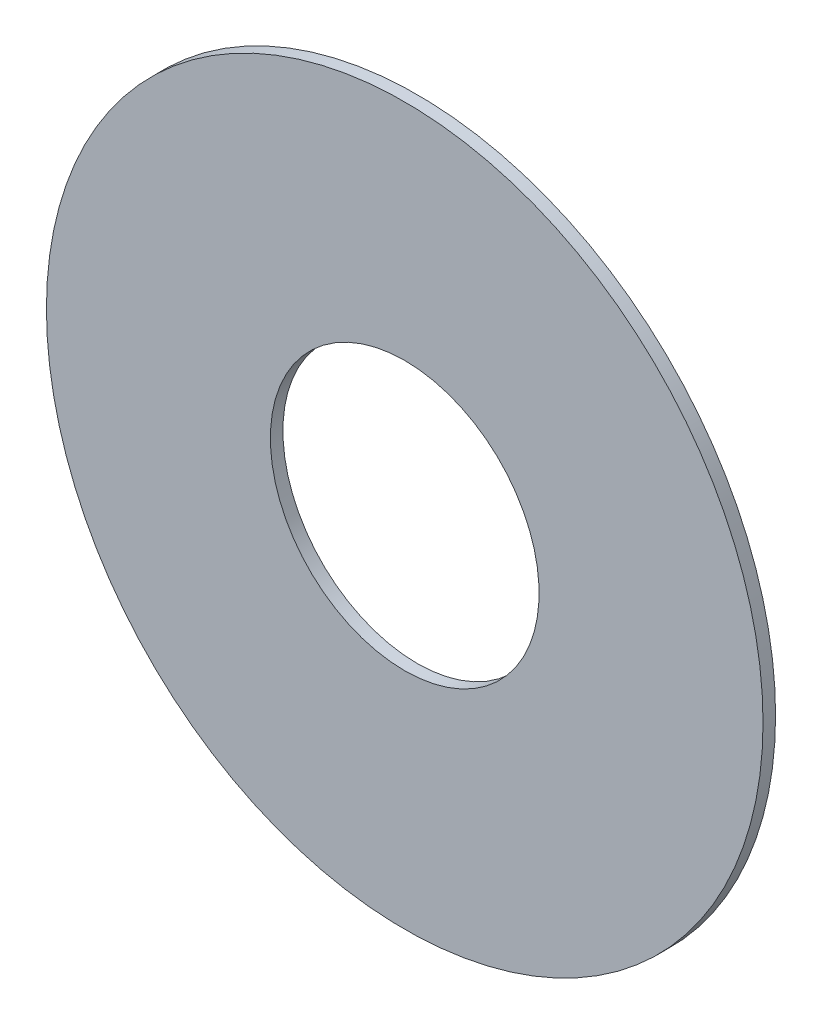
ISO-10303-21;
HEADER;
FILE_DESCRIPTION(('STEP AP214'),'2;1');
FILE_NAME('part.step','',(''),(''),'','','');
FILE_SCHEMA(('AUTOMOTIVE_DESIGN { 1 0 10303 214 1 1 1 1 }'));
ENDSEC;
DATA;
#1=APPLICATION_CONTEXT('core data for automotive mechanical design processes');
#2=APPLICATION_PROTOCOL_DEFINITION('international standard','automotive_design',2000,#1);
#3=PRODUCT_CONTEXT('',#1,'mechanical');
#4=PRODUCT('Part','Part','',(#3));
#5=PRODUCT_RELATED_PRODUCT_CATEGORY('part','',(#4));
#6=PRODUCT_DEFINITION_FORMATION('','',#4);
#7=PRODUCT_DEFINITION_CONTEXT('part definition',#1,'design');
#8=PRODUCT_DEFINITION('design','',#6,#7);
#9=PRODUCT_DEFINITION_SHAPE('','',#8);
#10=(LENGTH_UNIT() NAMED_UNIT(*) SI_UNIT(.MILLI.,.METRE.));
#11=(NAMED_UNIT(*) PLANE_ANGLE_UNIT() SI_UNIT($,.RADIAN.));
#12=(NAMED_UNIT(*) SI_UNIT($,.STERADIAN.) SOLID_ANGLE_UNIT());
#13=UNCERTAINTY_MEASURE_WITH_UNIT(LENGTH_MEASURE(1.E-05),#10,'distance_accuracy_value','');
#14=(GEOMETRIC_REPRESENTATION_CONTEXT(3) GLOBAL_UNCERTAINTY_ASSIGNED_CONTEXT((#13)) GLOBAL_UNIT_ASSIGNED_CONTEXT((#10,
#11,#12)) REPRESENTATION_CONTEXT('',''));
#15=CARTESIAN_POINT('',(0.,0.,0.));
#16=DIRECTION('',(0.,0.,1.));
#17=DIRECTION('',(1.,0.,0.));
#18=AXIS2_PLACEMENT_3D('',#15,#16,#17);
#19=CARTESIAN_POINT('',(141.224,-73.152,-0.045));
#20=DIRECTION('',(0.,0.,-1.));
#21=DIRECTION('',(0.,-1.,0.));
#22=AXIS2_PLACEMENT_3D('',#19,#20,#21);
#23=CYLINDRICAL_SURFACE('',#22,0.375);
#24=CARTESIAN_POINT('',(141.224,-73.152,-0.035));
#25=DIRECTION('',(0.,0.,-1.));
#26=DIRECTION('',(0.,-1.,0.));
#27=AXIS2_PLACEMENT_3D('',#24,#25,#26);
#28=CIRCLE('',#27,0.375);
#29=CARTESIAN_POINT('',(141.224,-73.527,-0.035));
#30=VERTEX_POINT('',#29);
#31=EDGE_CURVE('E25',#30,#30,#28,.T.);
#32=ORIENTED_EDGE('',*,*,#31,.T.);
#33=DIRECTION('',(0.,0.,1.));
#34=VECTOR('',#33,1.);
#35=CARTESIAN_POINT('',(141.224,-73.527,-0.045));
#36=LINE('',#35,#34);
#37=CARTESIAN_POINT('',(141.224,-73.527,0.));
#38=VERTEX_POINT('',#37);
#39=EDGE_CURVE('E11',#30,#38,#36,.T.);
#40=ORIENTED_EDGE('',*,*,#39,.T.);
#41=CARTESIAN_POINT('',(141.224,-73.152,0.));
#42=DIRECTION('',(0.,0.,-1.));
#43=DIRECTION('',(0.,-1.,0.));
#44=AXIS2_PLACEMENT_3D('',#41,#42,#43);
#45=CIRCLE('',#44,0.375);
#46=EDGE_CURVE('E68',#38,#38,#45,.T.);
#47=ORIENTED_EDGE('',*,*,#46,.F.);
#48=ORIENTED_EDGE('',*,*,#39,.F.);
#49=EDGE_LOOP('',(#32,#40,#47,#48));
#50=FACE_BOUND('',#49,.T.);
#51=ADVANCED_FACE('F17',(#50),#23,.F.);
#52=CARTESIAN_POINT('',(141.224,-73.152,-0.035));
#53=DIRECTION('',(0.,0.,1.));
#54=DIRECTION('',(1.,0.,0.));
#55=AXIS2_PLACEMENT_3D('',#52,#53,#54);
#56=PLANE('',#55);
#57=ORIENTED_EDGE('',*,*,#31,.F.);
#58=EDGE_LOOP('',(#57));
#59=FACE_BOUND('',#58,.T.);
#60=CARTESIAN_POINT('',(141.224,-73.152,-0.035));
#61=DIRECTION('',(0.,0.,1.));
#62=DIRECTION('',(1.,0.,0.));
#63=AXIS2_PLACEMENT_3D('',#60,#61,#62);
#64=CIRCLE('',#63,1.);
#65=CARTESIAN_POINT('',(142.224,-73.152,-0.035));
#66=VERTEX_POINT('',#65);
#67=EDGE_CURVE('E56',#66,#66,#64,.T.);
#68=ORIENTED_EDGE('',*,*,#67,.F.);
#69=EDGE_LOOP('',(#68));
#70=FACE_BOUND('',#69,.T.);
#71=ADVANCED_FACE('F75',(#59,#70),#56,.F.);
#72=CARTESIAN_POINT('',(141.224,-73.152,0.));
#73=DIRECTION('',(0.,0.,1.));
#74=DIRECTION('',(1.,0.,0.));
#75=AXIS2_PLACEMENT_3D('',#72,#73,#74);
#76=PLANE('',#75);
#77=ORIENTED_EDGE('',*,*,#46,.T.);
#78=EDGE_LOOP('',(#77));
#79=FACE_BOUND('',#78,.T.);
#80=CARTESIAN_POINT('',(141.224,-73.152,0.));
#81=DIRECTION('',(0.,0.,1.));
#82=DIRECTION('',(1.,0.,0.));
#83=AXIS2_PLACEMENT_3D('',#80,#81,#82);
#84=CIRCLE('',#83,1.);
#85=CARTESIAN_POINT('',(142.224,-73.152,0.));
#86=VERTEX_POINT('',#85);
#87=EDGE_CURVE('E54',#86,#86,#84,.T.);
#88=ORIENTED_EDGE('',*,*,#87,.T.);
#89=EDGE_LOOP('',(#88));
#90=FACE_BOUND('',#89,.T.);
#91=ADVANCED_FACE('F60',(#79,#90),#76,.T.);
#92=CARTESIAN_POINT('',(141.224,-73.152,-0.035));
#93=DIRECTION('',(0.,0.,1.));
#94=DIRECTION('',(1.,0.,0.));
#95=AXIS2_PLACEMENT_3D('',#92,#93,#94);
#96=CYLINDRICAL_SURFACE('',#95,1.);
#97=ORIENTED_EDGE('',*,*,#87,.F.);
#98=DIRECTION('',(0.,0.,1.));
#99=VECTOR('',#98,1.);
#100=CARTESIAN_POINT('',(142.224,-73.152,-0.035));
#101=LINE('',#100,#99);
#102=EDGE_CURVE('E51',#66,#86,#101,.T.);
#103=ORIENTED_EDGE('',*,*,#102,.F.);
#104=ORIENTED_EDGE('',*,*,#67,.T.);
#105=ORIENTED_EDGE('',*,*,#102,.T.);
#106=EDGE_LOOP('',(#97,#103,#104,#105));
#107=FACE_BOUND('',#106,.T.);
#108=ADVANCED_FACE('F53',(#107),#96,.T.);
#109=CLOSED_SHELL('',(#51,#71,#91,#108));
#110=MANIFOLD_SOLID_BREP('B1',#109);
#111=ADVANCED_BREP_SHAPE_REPRESENTATION('',(#18,#110),#14);
#112=SHAPE_DEFINITION_REPRESENTATION(#9,#111);
ENDSEC;
END-ISO-10303-21;
